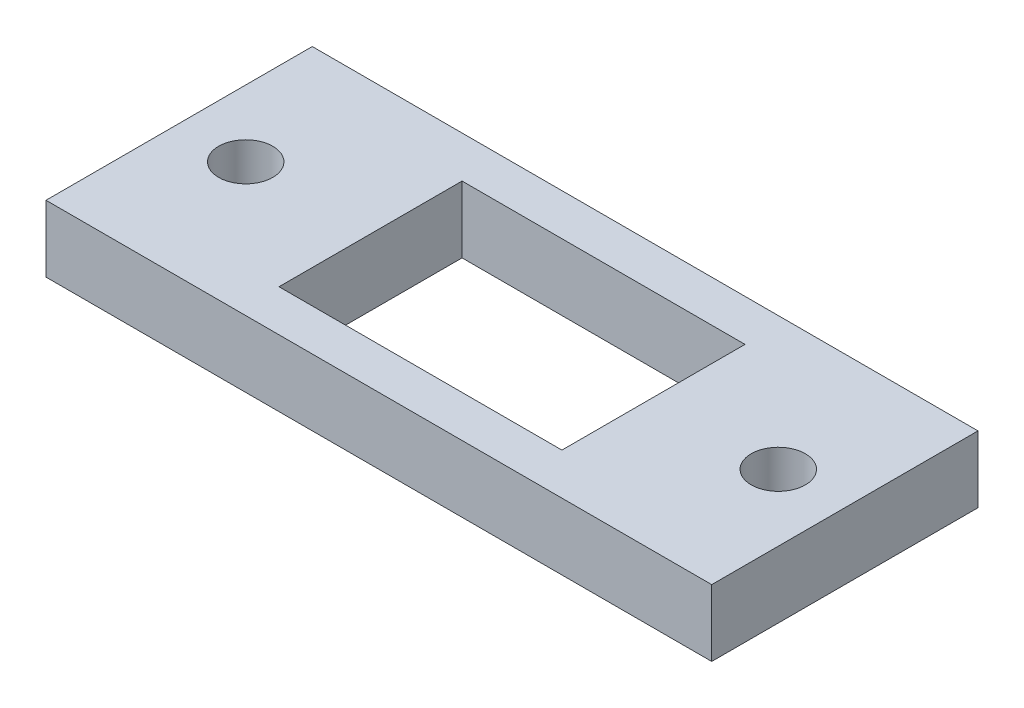
ISO-10303-21;
HEADER;
FILE_DESCRIPTION(('STEP AP214'),'2;1');
FILE_NAME('part.step','',(''),(''),'','','');
FILE_SCHEMA(('AUTOMOTIVE_DESIGN { 1 0 10303 214 1 1 1 1 }'));
ENDSEC;
DATA;
#1=APPLICATION_CONTEXT('core data for automotive mechanical design processes');
#2=APPLICATION_PROTOCOL_DEFINITION('international standard','automotive_design',2000,#1);
#3=PRODUCT_CONTEXT('',#1,'mechanical');
#4=PRODUCT('Part','Part','',(#3));
#5=PRODUCT_RELATED_PRODUCT_CATEGORY('part','',(#4));
#6=PRODUCT_DEFINITION_FORMATION('','',#4);
#7=PRODUCT_DEFINITION_CONTEXT('part definition',#1,'design');
#8=PRODUCT_DEFINITION('design','',#6,#7);
#9=PRODUCT_DEFINITION_SHAPE('','',#8);
#10=(LENGTH_UNIT() NAMED_UNIT(*) SI_UNIT(.MILLI.,.METRE.));
#11=(NAMED_UNIT(*) PLANE_ANGLE_UNIT() SI_UNIT($,.RADIAN.));
#12=(NAMED_UNIT(*) SI_UNIT($,.STERADIAN.) SOLID_ANGLE_UNIT());
#13=UNCERTAINTY_MEASURE_WITH_UNIT(LENGTH_MEASURE(1.E-05),#10,'distance_accuracy_value','');
#14=(GEOMETRIC_REPRESENTATION_CONTEXT(3) GLOBAL_UNCERTAINTY_ASSIGNED_CONTEXT((#13)) GLOBAL_UNIT_ASSIGNED_CONTEXT((#10,
#11,#12)) REPRESENTATION_CONTEXT('',''));
#15=CARTESIAN_POINT('',(0.,0.,0.));
#16=DIRECTION('',(0.,0.,1.));
#17=DIRECTION('',(1.,0.,0.));
#18=AXIS2_PLACEMENT_3D('',#15,#16,#17);
#19=CARTESIAN_POINT('',(0.,25.4,-101.6));
#20=DIRECTION('',(0.,-1.,0.));
#21=DIRECTION('',(0.,0.,-1.));
#22=AXIS2_PLACEMENT_3D('',#19,#20,#21);
#23=PLANE('',#22);
#24=CARTESIAN_POINT('',(228.6,25.4,-50.8));
#25=DIRECTION('',(0.,1.,0.));
#26=DIRECTION('',(0.,0.,1.));
#27=AXIS2_PLACEMENT_3D('',#24,#25,#26);
#28=CIRCLE('',#27,10.31875);
#29=CARTESIAN_POINT('',(228.6,25.4,-40.48125));
#30=VERTEX_POINT('',#29);
#31=EDGE_CURVE('E118',#30,#30,#28,.T.);
#32=ORIENTED_EDGE('',*,*,#31,.F.);
#33=EDGE_LOOP('',(#32));
#34=FACE_BOUND('',#33,.T.);
#35=DIRECTION('',(0.,0.,1.));
#36=VECTOR('',#35,1.);
#37=CARTESIAN_POINT('',(0.,25.4,0.));
#38=LINE('',#37,#36);
#39=CARTESIAN_POINT('',(0.,25.4,-101.6));
#40=VERTEX_POINT('',#39);
#41=CARTESIAN_POINT('',(0.,25.4,0.));
#42=VERTEX_POINT('',#41);
#43=EDGE_CURVE('E130',#40,#42,#38,.T.);
#44=ORIENTED_EDGE('',*,*,#43,.T.);
#45=DIRECTION('',(1.,0.,0.));
#46=VECTOR('',#45,1.);
#47=CARTESIAN_POINT('',(0.,25.4,0.));
#48=LINE('',#47,#46);
#49=CARTESIAN_POINT('',(254.,25.4,0.));
#50=VERTEX_POINT('',#49);
#51=EDGE_CURVE('E133',#42,#50,#48,.T.);
#52=ORIENTED_EDGE('',*,*,#51,.T.);
#53=DIRECTION('',(0.,0.,-1.));
#54=VECTOR('',#53,1.);
#55=CARTESIAN_POINT('',(254.,25.4,0.));
#56=LINE('',#55,#54);
#57=CARTESIAN_POINT('',(254.,25.4,-101.6));
#58=VERTEX_POINT('',#57);
#59=EDGE_CURVE('E136',#50,#58,#56,.T.);
#60=ORIENTED_EDGE('',*,*,#59,.T.);
#61=DIRECTION('',(-1.,0.,0.));
#62=VECTOR('',#61,1.);
#63=CARTESIAN_POINT('',(0.,25.4,-101.6));
#64=LINE('',#63,#62);
#65=EDGE_CURVE('E138',#58,#40,#64,.T.);
#66=ORIENTED_EDGE('',*,*,#65,.T.);
#67=EDGE_LOOP('',(#44,#52,#60,#66));
#68=FACE_BOUND('',#67,.T.);
#69=CARTESIAN_POINT('',(25.4,25.4,-50.8));
#70=DIRECTION('',(0.,1.,0.));
#71=DIRECTION('',(0.,0.,1.));
#72=AXIS2_PLACEMENT_3D('',#69,#70,#71);
#73=CIRCLE('',#72,10.31875);
#74=CARTESIAN_POINT('',(25.4,25.4,-40.48125));
#75=VERTEX_POINT('',#74);
#76=EDGE_CURVE('E124',#75,#75,#73,.T.);
#77=ORIENTED_EDGE('',*,*,#76,.F.);
#78=EDGE_LOOP('',(#77));
#79=FACE_BOUND('',#78,.T.);
#80=DIRECTION('',(0.,0.,1.));
#81=VECTOR('',#80,1.);
#82=CARTESIAN_POINT('',(73.025,25.4,-85.725));
#83=LINE('',#82,#81);
#84=CARTESIAN_POINT('',(73.025,25.4,-85.725));
#85=VERTEX_POINT('',#84);
#86=CARTESIAN_POINT('',(73.025,25.4,-15.875));
#87=VERTEX_POINT('',#86);
#88=EDGE_CURVE('E82',#85,#87,#83,.T.);
#89=ORIENTED_EDGE('',*,*,#88,.F.);
#90=DIRECTION('',(-1.,0.,0.));
#91=VECTOR('',#90,1.);
#92=CARTESIAN_POINT('',(73.025,25.4,-85.725));
#93=LINE('',#92,#91);
#94=CARTESIAN_POINT('',(180.975,25.4,-85.725));
#95=VERTEX_POINT('',#94);
#96=EDGE_CURVE('E104',#95,#85,#93,.T.);
#97=ORIENTED_EDGE('',*,*,#96,.F.);
#98=DIRECTION('',(0.,0.,-1.));
#99=VECTOR('',#98,1.);
#100=CARTESIAN_POINT('',(180.975,25.4,-85.725));
#101=LINE('',#100,#99);
#102=CARTESIAN_POINT('',(180.975,25.4,-15.875));
#103=VERTEX_POINT('',#102);
#104=EDGE_CURVE('E102',#103,#95,#101,.T.);
#105=ORIENTED_EDGE('',*,*,#104,.F.);
#106=DIRECTION('',(1.,0.,0.));
#107=VECTOR('',#106,1.);
#108=CARTESIAN_POINT('',(73.025,25.4,-15.875));
#109=LINE('',#108,#107);
#110=EDGE_CURVE('E90',#87,#103,#109,.T.);
#111=ORIENTED_EDGE('',*,*,#110,.F.);
#112=EDGE_LOOP('',(#89,#97,#105,#111));
#113=FACE_BOUND('',#112,.T.);
#114=ADVANCED_FACE('F17',(#34,#68,#79,#113),#23,.F.);
#115=CARTESIAN_POINT('',(0.,0.,-101.6));
#116=DIRECTION('',(0.,-1.,0.));
#117=DIRECTION('',(0.,0.,-1.));
#118=AXIS2_PLACEMENT_3D('',#115,#116,#117);
#119=PLANE('',#118);
#120=CARTESIAN_POINT('',(228.6,0.,-50.8));
#121=DIRECTION('',(0.,1.,0.));
#122=DIRECTION('',(0.,0.,1.));
#123=AXIS2_PLACEMENT_3D('',#120,#121,#122);
#124=CIRCLE('',#123,10.31875);
#125=CARTESIAN_POINT('',(228.6,0.,-40.48125));
#126=VERTEX_POINT('',#125);
#127=EDGE_CURVE('E98',#126,#126,#124,.T.);
#128=ORIENTED_EDGE('',*,*,#127,.T.);
#129=EDGE_LOOP('',(#128));
#130=FACE_BOUND('',#129,.T.);
#131=DIRECTION('',(0.,0.,1.));
#132=VECTOR('',#131,1.);
#133=CARTESIAN_POINT('',(0.,0.,0.));
#134=LINE('',#133,#132);
#135=CARTESIAN_POINT('',(0.,0.,-101.6));
#136=VERTEX_POINT('',#135);
#137=CARTESIAN_POINT('',(0.,0.,0.));
#138=VERTEX_POINT('',#137);
#139=EDGE_CURVE('E127',#136,#138,#134,.T.);
#140=ORIENTED_EDGE('',*,*,#139,.F.);
#141=DIRECTION('',(-1.,0.,0.));
#142=VECTOR('',#141,1.);
#143=CARTESIAN_POINT('',(0.,0.,-101.6));
#144=LINE('',#143,#142);
#145=CARTESIAN_POINT('',(254.,0.,-101.6));
#146=VERTEX_POINT('',#145);
#147=EDGE_CURVE('E134',#146,#136,#144,.T.);
#148=ORIENTED_EDGE('',*,*,#147,.F.);
#149=DIRECTION('',(0.,0.,-1.));
#150=VECTOR('',#149,1.);
#151=CARTESIAN_POINT('',(254.,0.,0.));
#152=LINE('',#151,#150);
#153=CARTESIAN_POINT('',(254.,0.,0.));
#154=VERTEX_POINT('',#153);
#155=EDGE_CURVE('E145',#154,#146,#152,.T.);
#156=ORIENTED_EDGE('',*,*,#155,.F.);
#157=DIRECTION('',(1.,0.,0.));
#158=VECTOR('',#157,1.);
#159=CARTESIAN_POINT('',(0.,0.,0.));
#160=LINE('',#159,#158);
#161=EDGE_CURVE('E143',#138,#154,#160,.T.);
#162=ORIENTED_EDGE('',*,*,#161,.F.);
#163=EDGE_LOOP('',(#140,#148,#156,#162));
#164=FACE_BOUND('',#163,.T.);
#165=CARTESIAN_POINT('',(25.4,0.,-50.8));
#166=DIRECTION('',(0.,1.,0.));
#167=DIRECTION('',(0.,0.,1.));
#168=AXIS2_PLACEMENT_3D('',#165,#166,#167);
#169=CIRCLE('',#168,10.31875);
#170=CARTESIAN_POINT('',(25.4,0.,-40.48125));
#171=VERTEX_POINT('',#170);
#172=EDGE_CURVE('E121',#171,#171,#169,.T.);
#173=ORIENTED_EDGE('',*,*,#172,.T.);
#174=EDGE_LOOP('',(#173));
#175=FACE_BOUND('',#174,.T.);
#176=DIRECTION('',(-1.,0.,0.));
#177=VECTOR('',#176,1.);
#178=CARTESIAN_POINT('',(73.025,0.,-85.725));
#179=LINE('',#178,#177);
#180=CARTESIAN_POINT('',(180.975,0.,-85.725));
#181=VERTEX_POINT('',#180);
#182=CARTESIAN_POINT('',(73.025,0.,-85.725));
#183=VERTEX_POINT('',#182);
#184=EDGE_CURVE('E91',#181,#183,#179,.T.);
#185=ORIENTED_EDGE('',*,*,#184,.T.);
#186=DIRECTION('',(0.,0.,1.));
#187=VECTOR('',#186,1.);
#188=CARTESIAN_POINT('',(73.025,0.,-85.725));
#189=LINE('',#188,#187);
#190=CARTESIAN_POINT('',(73.025,0.,-15.875));
#191=VERTEX_POINT('',#190);
#192=EDGE_CURVE('E40',#183,#191,#189,.T.);
#193=ORIENTED_EDGE('',*,*,#192,.T.);
#194=DIRECTION('',(1.,0.,0.));
#195=VECTOR('',#194,1.);
#196=CARTESIAN_POINT('',(73.025,0.,-15.875));
#197=LINE('',#196,#195);
#198=CARTESIAN_POINT('',(180.975,0.,-15.875));
#199=VERTEX_POINT('',#198);
#200=EDGE_CURVE('E97',#191,#199,#197,.T.);
#201=ORIENTED_EDGE('',*,*,#200,.T.);
#202=DIRECTION('',(0.,0.,-1.));
#203=VECTOR('',#202,1.);
#204=CARTESIAN_POINT('',(180.975,0.,-85.725));
#205=LINE('',#204,#203);
#206=EDGE_CURVE('E110',#199,#181,#205,.T.);
#207=ORIENTED_EDGE('',*,*,#206,.T.);
#208=EDGE_LOOP('',(#185,#193,#201,#207));
#209=FACE_BOUND('',#208,.T.);
#210=ADVANCED_FACE('F163',(#130,#164,#175,#209),#119,.T.);
#211=CARTESIAN_POINT('',(0.,25.4,0.));
#212=DIRECTION('',(1.,0.,0.));
#213=DIRECTION('',(0.,0.,-1.));
#214=AXIS2_PLACEMENT_3D('',#211,#212,#213);
#215=PLANE('',#214);
#216=ORIENTED_EDGE('',*,*,#139,.T.);
#217=DIRECTION('',(0.,-1.,0.));
#218=VECTOR('',#217,1.);
#219=CARTESIAN_POINT('',(0.,25.4,0.));
#220=LINE('',#219,#218);
#221=EDGE_CURVE('E11',#42,#138,#220,.T.);
#222=ORIENTED_EDGE('',*,*,#221,.F.);
#223=ORIENTED_EDGE('',*,*,#43,.F.);
#224=DIRECTION('',(0.,-1.,0.));
#225=VECTOR('',#224,1.);
#226=CARTESIAN_POINT('',(0.,25.4,-101.6));
#227=LINE('',#226,#225);
#228=EDGE_CURVE('E140',#40,#136,#227,.T.);
#229=ORIENTED_EDGE('',*,*,#228,.T.);
#230=EDGE_LOOP('',(#216,#222,#223,#229));
#231=FACE_BOUND('',#230,.T.);
#232=ADVANCED_FACE('F19',(#231),#215,.F.);
#233=CARTESIAN_POINT('',(0.,25.4,0.));
#234=DIRECTION('',(0.,0.,-1.));
#235=DIRECTION('',(-1.,0.,0.));
#236=AXIS2_PLACEMENT_3D('',#233,#234,#235);
#237=PLANE('',#236);
#238=ORIENTED_EDGE('',*,*,#161,.T.);
#239=DIRECTION('',(0.,-1.,0.));
#240=VECTOR('',#239,1.);
#241=CARTESIAN_POINT('',(254.,25.4,0.));
#242=LINE('',#241,#240);
#243=EDGE_CURVE('E25',#50,#154,#242,.T.);
#244=ORIENTED_EDGE('',*,*,#243,.F.);
#245=ORIENTED_EDGE('',*,*,#51,.F.);
#246=ORIENTED_EDGE('',*,*,#221,.T.);
#247=EDGE_LOOP('',(#238,#244,#245,#246));
#248=FACE_BOUND('',#247,.T.);
#249=ADVANCED_FACE('F174',(#248),#237,.F.);
#250=CARTESIAN_POINT('',(254.,25.4,0.));
#251=DIRECTION('',(-1.,0.,0.));
#252=DIRECTION('',(0.,0.,1.));
#253=AXIS2_PLACEMENT_3D('',#250,#251,#252);
#254=PLANE('',#253);
#255=ORIENTED_EDGE('',*,*,#155,.T.);
#256=DIRECTION('',(0.,-1.,0.));
#257=VECTOR('',#256,1.);
#258=CARTESIAN_POINT('',(254.,25.4,-101.6));
#259=LINE('',#258,#257);
#260=EDGE_CURVE('E150',#58,#146,#259,.T.);
#261=ORIENTED_EDGE('',*,*,#260,.F.);
#262=ORIENTED_EDGE('',*,*,#59,.F.);
#263=ORIENTED_EDGE('',*,*,#243,.T.);
#264=EDGE_LOOP('',(#255,#261,#262,#263));
#265=FACE_BOUND('',#264,.T.);
#266=ADVANCED_FACE('F157',(#265),#254,.F.);
#267=CARTESIAN_POINT('',(0.,25.4,-101.6));
#268=DIRECTION('',(0.,0.,1.));
#269=DIRECTION('',(1.,0.,0.));
#270=AXIS2_PLACEMENT_3D('',#267,#268,#269);
#271=PLANE('',#270);
#272=ORIENTED_EDGE('',*,*,#147,.T.);
#273=ORIENTED_EDGE('',*,*,#228,.F.);
#274=ORIENTED_EDGE('',*,*,#65,.F.);
#275=ORIENTED_EDGE('',*,*,#260,.T.);
#276=EDGE_LOOP('',(#272,#273,#274,#275));
#277=FACE_BOUND('',#276,.T.);
#278=ADVANCED_FACE('F167',(#277),#271,.F.);
#279=CARTESIAN_POINT('',(25.4,25.4,-50.8));
#280=DIRECTION('',(0.,-1.,0.));
#281=DIRECTION('',(0.,0.,-1.));
#282=AXIS2_PLACEMENT_3D('',#279,#280,#281);
#283=CYLINDRICAL_SURFACE('',#282,10.31875);
#284=ORIENTED_EDGE('',*,*,#76,.T.);
#285=EDGE_LOOP('',(#284));
#286=FACE_BOUND('',#285,.T.);
#287=ORIENTED_EDGE('',*,*,#172,.F.);
#288=EDGE_LOOP('',(#287));
#289=FACE_BOUND('',#288,.T.);
#290=ADVANCED_FACE('F194',(#286,#289),#283,.F.);
#291=CARTESIAN_POINT('',(228.6,25.4,-50.8));
#292=DIRECTION('',(0.,-1.,0.));
#293=DIRECTION('',(0.,0.,-1.));
#294=AXIS2_PLACEMENT_3D('',#291,#292,#293);
#295=CYLINDRICAL_SURFACE('',#294,10.31875);
#296=ORIENTED_EDGE('',*,*,#31,.T.);
#297=EDGE_LOOP('',(#296));
#298=FACE_BOUND('',#297,.T.);
#299=ORIENTED_EDGE('',*,*,#127,.F.);
#300=EDGE_LOOP('',(#299));
#301=FACE_BOUND('',#300,.T.);
#302=ADVANCED_FACE('F202',(#298,#301),#295,.F.);
#303=CARTESIAN_POINT('',(73.025,25.4,-85.725));
#304=DIRECTION('',(1.,0.,0.));
#305=DIRECTION('',(0.,0.,-1.));
#306=AXIS2_PLACEMENT_3D('',#303,#304,#305);
#307=PLANE('',#306);
#308=ORIENTED_EDGE('',*,*,#192,.F.);
#309=DIRECTION('',(0.,-1.,0.));
#310=VECTOR('',#309,1.);
#311=CARTESIAN_POINT('',(73.025,25.4,-85.725));
#312=LINE('',#311,#310);
#313=EDGE_CURVE('E86',#85,#183,#312,.T.);
#314=ORIENTED_EDGE('',*,*,#313,.F.);
#315=ORIENTED_EDGE('',*,*,#88,.T.);
#316=DIRECTION('',(0.,-1.,0.));
#317=VECTOR('',#316,1.);
#318=CARTESIAN_POINT('',(73.025,25.4,-15.875));
#319=LINE('',#318,#317);
#320=EDGE_CURVE('E85',#87,#191,#319,.T.);
#321=ORIENTED_EDGE('',*,*,#320,.T.);
#322=EDGE_LOOP('',(#308,#314,#315,#321));
#323=FACE_BOUND('',#322,.T.);
#324=ADVANCED_FACE('F84',(#323),#307,.T.);
#325=CARTESIAN_POINT('',(73.025,25.4,-15.875));
#326=DIRECTION('',(0.,0.,-1.));
#327=DIRECTION('',(-1.,0.,0.));
#328=AXIS2_PLACEMENT_3D('',#325,#326,#327);
#329=PLANE('',#328);
#330=ORIENTED_EDGE('',*,*,#200,.F.);
#331=ORIENTED_EDGE('',*,*,#320,.F.);
#332=ORIENTED_EDGE('',*,*,#110,.T.);
#333=DIRECTION('',(0.,-1.,0.));
#334=VECTOR('',#333,1.);
#335=CARTESIAN_POINT('',(180.975,25.4,-15.875));
#336=LINE('',#335,#334);
#337=EDGE_CURVE('E99',#103,#199,#336,.T.);
#338=ORIENTED_EDGE('',*,*,#337,.T.);
#339=EDGE_LOOP('',(#330,#331,#332,#338));
#340=FACE_BOUND('',#339,.T.);
#341=ADVANCED_FACE('F94',(#340),#329,.T.);
#342=CARTESIAN_POINT('',(180.975,25.4,-85.725));
#343=DIRECTION('',(-1.,0.,0.));
#344=DIRECTION('',(0.,0.,1.));
#345=AXIS2_PLACEMENT_3D('',#342,#343,#344);
#346=PLANE('',#345);
#347=ORIENTED_EDGE('',*,*,#206,.F.);
#348=ORIENTED_EDGE('',*,*,#337,.F.);
#349=ORIENTED_EDGE('',*,*,#104,.T.);
#350=DIRECTION('',(0.,-1.,0.));
#351=VECTOR('',#350,1.);
#352=CARTESIAN_POINT('',(180.975,25.4,-85.725));
#353=LINE('',#352,#351);
#354=EDGE_CURVE('E32',#95,#181,#353,.T.);
#355=ORIENTED_EDGE('',*,*,#354,.T.);
#356=EDGE_LOOP('',(#347,#348,#349,#355));
#357=FACE_BOUND('',#356,.T.);
#358=ADVANCED_FACE('F216',(#357),#346,.T.);
#359=CARTESIAN_POINT('',(73.025,25.4,-85.725));
#360=DIRECTION('',(0.,0.,1.));
#361=DIRECTION('',(1.,0.,0.));
#362=AXIS2_PLACEMENT_3D('',#359,#360,#361);
#363=PLANE('',#362);
#364=ORIENTED_EDGE('',*,*,#184,.F.);
#365=ORIENTED_EDGE('',*,*,#354,.F.);
#366=ORIENTED_EDGE('',*,*,#96,.T.);
#367=ORIENTED_EDGE('',*,*,#313,.T.);
#368=EDGE_LOOP('',(#364,#365,#366,#367));
#369=FACE_BOUND('',#368,.T.);
#370=ADVANCED_FACE('F214',(#369),#363,.T.);
#371=CLOSED_SHELL('',(#114,#210,#232,#249,#266,#278,#290,#302,#324,#341,#358,#370));
#372=MANIFOLD_SOLID_BREP('B1',#371);
#373=ADVANCED_BREP_SHAPE_REPRESENTATION('',(#18,#372),#14);
#374=SHAPE_DEFINITION_REPRESENTATION(#9,#373);
ENDSEC;
END-ISO-10303-21;
